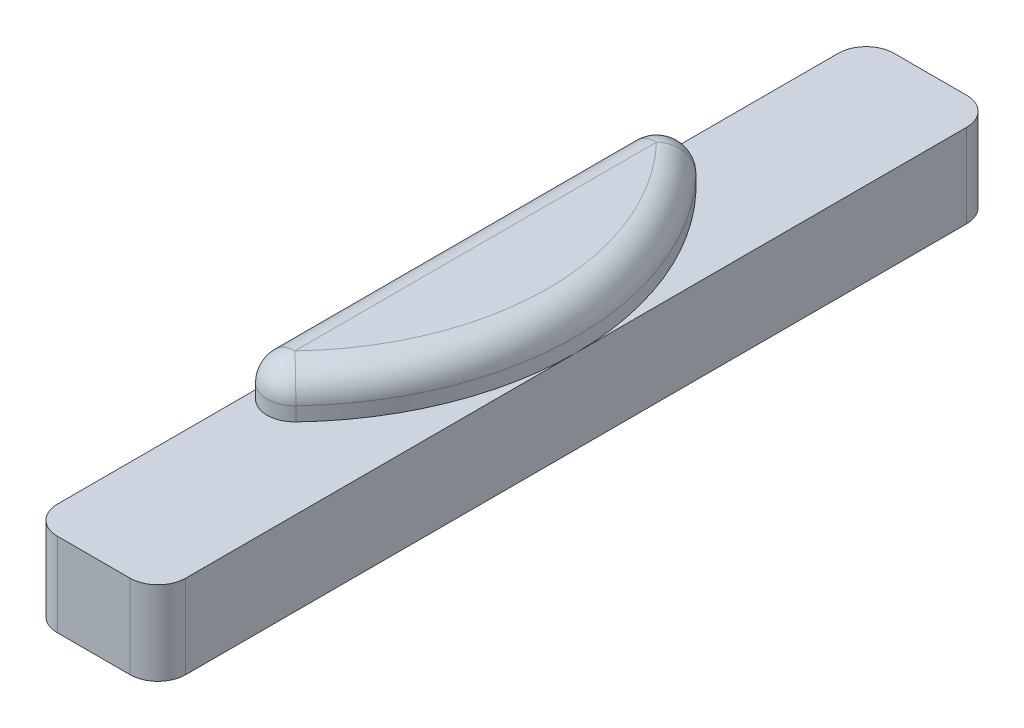
ISO-10303-21;
HEADER;
FILE_DESCRIPTION(('STEP AP214'),'2;1');
FILE_NAME('part.step','',(''),(''),'','','');
FILE_SCHEMA(('AUTOMOTIVE_DESIGN { 1 0 10303 214 1 1 1 1 }'));
ENDSEC;
DATA;
#1=APPLICATION_CONTEXT('core data for automotive mechanical design processes');
#2=APPLICATION_PROTOCOL_DEFINITION('international standard','automotive_design',2000,#1);
#3=PRODUCT_CONTEXT('',#1,'mechanical');
#4=PRODUCT('Part','Part','',(#3));
#5=PRODUCT_RELATED_PRODUCT_CATEGORY('part','',(#4));
#6=PRODUCT_DEFINITION_FORMATION('','',#4);
#7=PRODUCT_DEFINITION_CONTEXT('part definition',#1,'design');
#8=PRODUCT_DEFINITION('design','',#6,#7);
#9=PRODUCT_DEFINITION_SHAPE('','',#8);
#10=(LENGTH_UNIT() NAMED_UNIT(*) SI_UNIT(.MILLI.,.METRE.));
#11=(NAMED_UNIT(*) PLANE_ANGLE_UNIT() SI_UNIT($,.RADIAN.));
#12=(NAMED_UNIT(*) SI_UNIT($,.STERADIAN.) SOLID_ANGLE_UNIT());
#13=UNCERTAINTY_MEASURE_WITH_UNIT(LENGTH_MEASURE(1.E-05),#10,'distance_accuracy_value','');
#14=(GEOMETRIC_REPRESENTATION_CONTEXT(3) GLOBAL_UNCERTAINTY_ASSIGNED_CONTEXT((#13)) GLOBAL_UNIT_ASSIGNED_CONTEXT((#10,
#11,#12)) REPRESENTATION_CONTEXT('',''));
#15=CARTESIAN_POINT('',(0.,0.,0.));
#16=DIRECTION('',(0.,0.,1.));
#17=DIRECTION('',(1.,0.,0.));
#18=AXIS2_PLACEMENT_3D('',#15,#16,#17);
#19=CARTESIAN_POINT('',(0.,6.,0.));
#20=DIRECTION('',(0.,1.,0.));
#21=DIRECTION('',(0.,0.,1.));
#22=AXIS2_PLACEMENT_3D('',#19,#20,#21);
#23=PLANE('',#22);
#24=DIRECTION('',(0.,0.,-1.));
#25=VECTOR('',#24,1.);
#26=CARTESIAN_POINT('',(0.,6.,0.));
#27=LINE('',#26,#25);
#28=CARTESIAN_POINT('',(0.,6.,10.75));
#29=VERTEX_POINT('',#28);
#30=CARTESIAN_POINT('',(0.,6.,-4.28128765065706));
#31=VERTEX_POINT('',#30);
#32=EDGE_CURVE('E177',#29,#31,#27,.T.);
#33=ORIENTED_EDGE('',*,*,#32,.F.);
#34=CARTESIAN_POINT('',(2.,6.,10.75));
#35=DIRECTION('',(0.,1.,0.));
#36=DIRECTION('',(0.,0.,1.));
#37=AXIS2_PLACEMENT_3D('',#34,#35,#36);
#38=CIRCLE('',#37,2.);
#39=CARTESIAN_POINT('',(2.,6.,12.75));
#40=VERTEX_POINT('',#39);
#41=EDGE_CURVE('E246',#29,#40,#38,.T.);
#42=ORIENTED_EDGE('',*,*,#41,.T.);
#43=DIRECTION('',(1.,0.,0.));
#44=VECTOR('',#43,1.);
#45=CARTESIAN_POINT('',(0.,6.,12.75));
#46=LINE('',#45,#44);
#47=CARTESIAN_POINT('',(7.2,6.,12.75));
#48=VERTEX_POINT('',#47);
#49=EDGE_CURVE('E176',#40,#48,#46,.T.);
#50=ORIENTED_EDGE('',*,*,#49,.T.);
#51=CARTESIAN_POINT('',(7.2,6.,10.75));
#52=DIRECTION('',(0.,1.,0.));
#53=DIRECTION('',(0.,0.,1.));
#54=AXIS2_PLACEMENT_3D('',#51,#52,#53);
#55=CIRCLE('',#54,2.);
#56=CARTESIAN_POINT('',(9.2,6.,10.75));
#57=VERTEX_POINT('',#56);
#58=EDGE_CURVE('E148',#48,#57,#55,.T.);
#59=ORIENTED_EDGE('',*,*,#58,.T.);
#60=DIRECTION('',(0.,0.,-1.));
#61=VECTOR('',#60,1.);
#62=CARTESIAN_POINT('',(9.2,6.,0.));
#63=LINE('',#62,#61);
#64=CARTESIAN_POINT('',(9.2,6.,-17.25));
#65=VERTEX_POINT('',#64);
#66=EDGE_CURVE('E141',#57,#65,#63,.T.);
#67=ORIENTED_EDGE('',*,*,#66,.T.);
#68=CARTESIAN_POINT('',(-11.571875,6.,-17.25));
#69=DIRECTION('',(0.,1.,0.));
#70=DIRECTION('',(0.,0.,1.));
#71=AXIS2_PLACEMENT_3D('',#68,#69,#70);
#72=CIRCLE('',#71,20.771875);
#73=CARTESIAN_POINT('',(3.44597969036124,6.,-2.8995703369265));
#74=VERTEX_POINT('',#73);
#75=EDGE_CURVE('E145',#74,#65,#72,.T.);
#76=ORIENTED_EDGE('',*,*,#75,.F.);
#77=CARTESIAN_POINT('',(2.,6.,-4.28128765065706));
#78=DIRECTION('',(0.,1.,0.));
#79=DIRECTION('',(0.,0.,1.));
#80=AXIS2_PLACEMENT_3D('',#77,#78,#79);
#81=CIRCLE('',#80,2.);
#82=EDGE_CURVE('E213',#74,#31,#81,.F.);
#83=ORIENTED_EDGE('',*,*,#82,.T.);
#84=EDGE_LOOP('',(#33,#42,#50,#59,#67,#76,#83));
#85=FACE_BOUND('',#84,.T.);
#86=ADVANCED_FACE('F43',(#85),#23,.T.);
#87=CARTESIAN_POINT('',(0.,6.,0.));
#88=DIRECTION('',(-1.,0.,0.));
#89=DIRECTION('',(0.,0.,1.));
#90=AXIS2_PLACEMENT_3D('',#87,#88,#89);
#91=PLANE('',#90);
#92=DIRECTION('',(0.,0.,-1.));
#93=VECTOR('',#92,1.);
#94=CARTESIAN_POINT('',(0.,0.,0.));
#95=LINE('',#94,#93);
#96=CARTESIAN_POINT('',(0.,0.,10.75));
#97=VERTEX_POINT('',#96);
#98=CARTESIAN_POINT('',(0.,0.,-45.25));
#99=VERTEX_POINT('',#98);
#100=EDGE_CURVE('E166',#97,#99,#95,.T.);
#101=ORIENTED_EDGE('',*,*,#100,.F.);
#102=DIRECTION('',(0.,-1.,0.));
#103=VECTOR('',#102,1.);
#104=CARTESIAN_POINT('',(0.,6.,10.75));
#105=LINE('',#104,#103);
#106=EDGE_CURVE('E243',#97,#29,#105,.F.);
#107=ORIENTED_EDGE('',*,*,#106,.T.);
#108=ORIENTED_EDGE('',*,*,#32,.T.);
#109=DIRECTION('',(0.,-1.,0.));
#110=VECTOR('',#109,1.);
#111=CARTESIAN_POINT('',(0.,6.,-4.28128765065706));
#112=LINE('',#111,#110);
#113=CARTESIAN_POINT('',(0.,7.,-4.28128765065706));
#114=VERTEX_POINT('',#113);
#115=EDGE_CURVE('E205',#31,#114,#112,.F.);
#116=ORIENTED_EDGE('',*,*,#115,.T.);
#117=DIRECTION('',(0.,0.,-1.));
#118=VECTOR('',#117,1.);
#119=CARTESIAN_POINT('',(0.,7.,0.));
#120=LINE('',#119,#118);
#121=CARTESIAN_POINT('',(0.,7.,-30.2187123493429));
#122=VERTEX_POINT('',#121);
#123=EDGE_CURVE('E203',#114,#122,#120,.T.);
#124=ORIENTED_EDGE('',*,*,#123,.T.);
#125=DIRECTION('',(0.,-1.,0.));
#126=VECTOR('',#125,1.);
#127=CARTESIAN_POINT('',(0.,6.,-30.2187123493429));
#128=LINE('',#127,#126);
#129=CARTESIAN_POINT('',(0.,6.,-30.2187123493429));
#130=VERTEX_POINT('',#129);
#131=EDGE_CURVE('E200',#122,#130,#128,.T.);
#132=ORIENTED_EDGE('',*,*,#131,.T.);
#133=CARTESIAN_POINT('',(0.,6.,-45.25));
#134=VERTEX_POINT('',#133);
#135=EDGE_CURVE('E192',#130,#134,#27,.T.);
#136=ORIENTED_EDGE('',*,*,#135,.T.);
#137=DIRECTION('',(0.,-1.,0.));
#138=VECTOR('',#137,1.);
#139=CARTESIAN_POINT('',(0.,0.,-45.25));
#140=LINE('',#139,#138);
#141=EDGE_CURVE('E240',#134,#99,#140,.T.);
#142=ORIENTED_EDGE('',*,*,#141,.T.);
#143=EDGE_LOOP('',(#101,#107,#108,#116,#124,#132,#136,#142));
#144=FACE_BOUND('',#143,.T.);
#145=ADVANCED_FACE('F260',(#144),#91,.T.);
#146=CARTESIAN_POINT('',(0.,6.,12.75));
#147=DIRECTION('',(0.,0.,-1.));
#148=DIRECTION('',(-1.,0.,0.));
#149=AXIS2_PLACEMENT_3D('',#146,#147,#148);
#150=PLANE('',#149);
#151=ORIENTED_EDGE('',*,*,#49,.F.);
#152=DIRECTION('',(0.,-1.,0.));
#153=VECTOR('',#152,1.);
#154=CARTESIAN_POINT('',(2.,0.,12.75));
#155=LINE('',#154,#153);
#156=CARTESIAN_POINT('',(2.,0.,12.75));
#157=VERTEX_POINT('',#156);
#158=EDGE_CURVE('E229',#40,#157,#155,.T.);
#159=ORIENTED_EDGE('',*,*,#158,.T.);
#160=DIRECTION('',(1.,0.,0.));
#161=VECTOR('',#160,1.);
#162=CARTESIAN_POINT('',(0.,0.,12.75));
#163=LINE('',#162,#161);
#164=CARTESIAN_POINT('',(7.2,0.,12.75));
#165=VERTEX_POINT('',#164);
#166=EDGE_CURVE('E185',#157,#165,#163,.T.);
#167=ORIENTED_EDGE('',*,*,#166,.T.);
#168=DIRECTION('',(0.,-1.,0.));
#169=VECTOR('',#168,1.);
#170=CARTESIAN_POINT('',(7.2,6.,12.75));
#171=LINE('',#170,#169);
#172=EDGE_CURVE('E216',#165,#48,#171,.F.);
#173=ORIENTED_EDGE('',*,*,#172,.T.);
#174=EDGE_LOOP('',(#151,#159,#167,#173));
#175=FACE_BOUND('',#174,.T.);
#176=ADVANCED_FACE('F276',(#175),#150,.F.);
#177=CARTESIAN_POINT('',(9.2,6.,0.));
#178=DIRECTION('',(-1.,0.,0.));
#179=DIRECTION('',(0.,0.,1.));
#180=AXIS2_PLACEMENT_3D('',#177,#178,#179);
#181=PLANE('',#180);
#182=ORIENTED_EDGE('',*,*,#66,.F.);
#183=DIRECTION('',(0.,-1.,0.));
#184=VECTOR('',#183,1.);
#185=CARTESIAN_POINT('',(9.2,6.,10.75));
#186=LINE('',#185,#184);
#187=CARTESIAN_POINT('',(9.2,0.,10.75));
#188=VERTEX_POINT('',#187);
#189=EDGE_CURVE('E249',#57,#188,#186,.T.);
#190=ORIENTED_EDGE('',*,*,#189,.T.);
#191=DIRECTION('',(0.,0.,-1.));
#192=VECTOR('',#191,1.);
#193=CARTESIAN_POINT('',(9.2,0.,0.));
#194=LINE('',#193,#192);
#195=CARTESIAN_POINT('',(9.2,0.,-45.25));
#196=VERTEX_POINT('',#195);
#197=EDGE_CURVE('E188',#188,#196,#194,.T.);
#198=ORIENTED_EDGE('',*,*,#197,.T.);
#199=DIRECTION('',(0.,-1.,0.));
#200=VECTOR('',#199,1.);
#201=CARTESIAN_POINT('',(9.2,6.,-45.25));
#202=LINE('',#201,#200);
#203=CARTESIAN_POINT('',(9.2,6.,-45.25));
#204=VERTEX_POINT('',#203);
#205=EDGE_CURVE('E175',#196,#204,#202,.F.);
#206=ORIENTED_EDGE('',*,*,#205,.T.);
#207=EDGE_CURVE('E154',#65,#204,#63,.T.);
#208=ORIENTED_EDGE('',*,*,#207,.F.);
#209=EDGE_LOOP('',(#182,#190,#198,#206,#208));
#210=FACE_BOUND('',#209,.T.);
#211=ADVANCED_FACE('F172',(#210),#181,.F.);
#212=CARTESIAN_POINT('',(0.,6.,-47.25));
#213=DIRECTION('',(0.,0.,1.));
#214=DIRECTION('',(1.,0.,0.));
#215=AXIS2_PLACEMENT_3D('',#212,#213,#214);
#216=PLANE('',#215);
#217=DIRECTION('',(-1.,0.,0.));
#218=VECTOR('',#217,1.);
#219=CARTESIAN_POINT('',(0.,6.,-47.25));
#220=LINE('',#219,#218);
#221=CARTESIAN_POINT('',(7.2,6.,-47.25));
#222=VERTEX_POINT('',#221);
#223=CARTESIAN_POINT('',(2.,6.,-47.25));
#224=VERTEX_POINT('',#223);
#225=EDGE_CURVE('E153',#222,#224,#220,.T.);
#226=ORIENTED_EDGE('',*,*,#225,.F.);
#227=DIRECTION('',(0.,-1.,0.));
#228=VECTOR('',#227,1.);
#229=CARTESIAN_POINT('',(7.2,6.,-47.25));
#230=LINE('',#229,#228);
#231=CARTESIAN_POINT('',(7.2,0.,-47.25));
#232=VERTEX_POINT('',#231);
#233=EDGE_CURVE('E252',#222,#232,#230,.T.);
#234=ORIENTED_EDGE('',*,*,#233,.T.);
#235=DIRECTION('',(-1.,0.,0.));
#236=VECTOR('',#235,1.);
#237=CARTESIAN_POINT('',(0.,0.,-47.25));
#238=LINE('',#237,#236);
#239=CARTESIAN_POINT('',(2.,0.,-47.25));
#240=VERTEX_POINT('',#239);
#241=EDGE_CURVE('E190',#232,#240,#238,.T.);
#242=ORIENTED_EDGE('',*,*,#241,.T.);
#243=DIRECTION('',(0.,-1.,0.));
#244=VECTOR('',#243,1.);
#245=CARTESIAN_POINT('',(2.,6.,-47.25));
#246=LINE('',#245,#244);
#247=EDGE_CURVE('E58',#240,#224,#246,.F.);
#248=ORIENTED_EDGE('',*,*,#247,.T.);
#249=EDGE_LOOP('',(#226,#234,#242,#248));
#250=FACE_BOUND('',#249,.T.);
#251=ADVANCED_FACE('F266',(#250),#216,.F.);
#252=ORIENTED_EDGE('',*,*,#207,.T.);
#253=CARTESIAN_POINT('',(7.2,6.,-45.25));
#254=DIRECTION('',(0.,1.,0.));
#255=DIRECTION('',(0.,0.,1.));
#256=AXIS2_PLACEMENT_3D('',#253,#254,#255);
#257=CIRCLE('',#256,2.);
#258=EDGE_CURVE('E11',#204,#222,#257,.T.);
#259=ORIENTED_EDGE('',*,*,#258,.T.);
#260=ORIENTED_EDGE('',*,*,#225,.T.);
#261=CARTESIAN_POINT('',(2.,6.,-45.25));
#262=DIRECTION('',(0.,1.,0.));
#263=DIRECTION('',(0.,0.,1.));
#264=AXIS2_PLACEMENT_3D('',#261,#262,#263);
#265=CIRCLE('',#264,2.);
#266=EDGE_CURVE('E51',#224,#134,#265,.T.);
#267=ORIENTED_EDGE('',*,*,#266,.T.);
#268=ORIENTED_EDGE('',*,*,#135,.F.);
#269=CARTESIAN_POINT('',(2.,6.,-30.2187123493429));
#270=DIRECTION('',(0.,1.,0.));
#271=DIRECTION('',(0.,0.,1.));
#272=AXIS2_PLACEMENT_3D('',#269,#270,#271);
#273=CIRCLE('',#272,2.);
#274=CARTESIAN_POINT('',(3.44597969036124,6.,-31.6004296630735));
#275=VERTEX_POINT('',#274);
#276=EDGE_CURVE('E170',#130,#275,#273,.F.);
#277=ORIENTED_EDGE('',*,*,#276,.T.);
#278=EDGE_CURVE('E162',#65,#275,#72,.T.);
#279=ORIENTED_EDGE('',*,*,#278,.F.);
#280=EDGE_LOOP('',(#252,#259,#260,#267,#268,#277,#279));
#281=FACE_BOUND('',#280,.T.);
#282=ADVANCED_FACE('F168',(#281),#23,.T.);
#283=CARTESIAN_POINT('',(0.,0.,0.));
#284=DIRECTION('',(0.,1.,0.));
#285=DIRECTION('',(0.,0.,1.));
#286=AXIS2_PLACEMENT_3D('',#283,#284,#285);
#287=PLANE('',#286);
#288=ORIENTED_EDGE('',*,*,#166,.F.);
#289=CARTESIAN_POINT('',(2.,0.,10.75));
#290=DIRECTION('',(0.,1.,0.));
#291=DIRECTION('',(0.,0.,1.));
#292=AXIS2_PLACEMENT_3D('',#289,#290,#291);
#293=CIRCLE('',#292,2.);
#294=EDGE_CURVE('E238',#157,#97,#293,.F.);
#295=ORIENTED_EDGE('',*,*,#294,.T.);
#296=ORIENTED_EDGE('',*,*,#100,.T.);
#297=CARTESIAN_POINT('',(2.,0.,-45.25));
#298=DIRECTION('',(0.,1.,0.));
#299=DIRECTION('',(0.,0.,1.));
#300=AXIS2_PLACEMENT_3D('',#297,#298,#299);
#301=CIRCLE('',#300,2.);
#302=EDGE_CURVE('E232',#99,#240,#301,.F.);
#303=ORIENTED_EDGE('',*,*,#302,.T.);
#304=ORIENTED_EDGE('',*,*,#241,.F.);
#305=CARTESIAN_POINT('',(7.2,0.,-45.25));
#306=DIRECTION('',(0.,1.,0.));
#307=DIRECTION('',(0.,0.,1.));
#308=AXIS2_PLACEMENT_3D('',#305,#306,#307);
#309=CIRCLE('',#308,2.);
#310=EDGE_CURVE('E234',#232,#196,#309,.F.);
#311=ORIENTED_EDGE('',*,*,#310,.T.);
#312=ORIENTED_EDGE('',*,*,#197,.F.);
#313=CARTESIAN_POINT('',(7.2,0.,10.75));
#314=DIRECTION('',(0.,1.,0.));
#315=DIRECTION('',(0.,0.,1.));
#316=AXIS2_PLACEMENT_3D('',#313,#314,#315);
#317=CIRCLE('',#316,2.);
#318=EDGE_CURVE('E236',#188,#165,#317,.F.);
#319=ORIENTED_EDGE('',*,*,#318,.T.);
#320=EDGE_LOOP('',(#288,#295,#296,#303,#304,#311,#312,#319));
#321=FACE_BOUND('',#320,.T.);
#322=ADVANCED_FACE('F265',(#321),#287,.F.);
#323=CARTESIAN_POINT('',(-11.571875,9.,-17.25));
#324=DIRECTION('',(0.,-1.,0.));
#325=DIRECTION('',(0.,0.,-1.));
#326=AXIS2_PLACEMENT_3D('',#323,#324,#325);
#327=CYLINDRICAL_SURFACE('',#326,20.771875);
#328=CARTESIAN_POINT('',(-11.571875,7.,-17.25));
#329=DIRECTION('',(0.,1.,0.));
#330=DIRECTION('',(0.,0.,1.));
#331=AXIS2_PLACEMENT_3D('',#328,#329,#330);
#332=CIRCLE('',#331,20.771875);
#333=CARTESIAN_POINT('',(3.44597969036125,7.,-31.6004296630735));
#334=VERTEX_POINT('',#333);
#335=CARTESIAN_POINT('',(3.44597969036124,7.,-2.8995703369265));
#336=VERTEX_POINT('',#335);
#337=EDGE_CURVE('E182',#334,#336,#332,.F.);
#338=ORIENTED_EDGE('',*,*,#337,.T.);
#339=DIRECTION('',(0.,-1.,0.));
#340=VECTOR('',#339,1.);
#341=CARTESIAN_POINT('',(3.44597969036124,9.,-2.8995703369265));
#342=LINE('',#341,#340);
#343=EDGE_CURVE('E165',#336,#74,#342,.T.);
#344=ORIENTED_EDGE('',*,*,#343,.T.);
#345=ORIENTED_EDGE('',*,*,#75,.T.);
#346=ORIENTED_EDGE('',*,*,#278,.T.);
#347=DIRECTION('',(0.,-1.,0.));
#348=VECTOR('',#347,1.);
#349=CARTESIAN_POINT('',(3.44597969036125,9.,-31.6004296630735));
#350=LINE('',#349,#348);
#351=EDGE_CURVE('E197',#275,#334,#350,.F.);
#352=ORIENTED_EDGE('',*,*,#351,.T.);
#353=EDGE_LOOP('',(#338,#344,#345,#346,#352));
#354=FACE_BOUND('',#353,.T.);
#355=ADVANCED_FACE('F161',(#354),#327,.T.);
#356=CARTESIAN_POINT('',(0.,9.,0.));
#357=DIRECTION('',(0.,1.,0.));
#358=DIRECTION('',(0.,0.,1.));
#359=AXIS2_PLACEMENT_3D('',#356,#357,#358);
#360=PLANE('',#359);
#361=CARTESIAN_POINT('',(-11.571875,9.,-17.25));
#362=DIRECTION('',(0.,1.,0.));
#363=DIRECTION('',(0.,0.,1.));
#364=AXIS2_PLACEMENT_3D('',#361,#362,#363);
#365=CIRCLE('',#364,18.771875);
#366=CARTESIAN_POINT('',(2.,9.,-4.28128765065706));
#367=VERTEX_POINT('',#366);
#368=CARTESIAN_POINT('',(2.,9.,-30.2187123493429));
#369=VERTEX_POINT('',#368);
#370=EDGE_CURVE('E194',#367,#369,#365,.T.);
#371=ORIENTED_EDGE('',*,*,#370,.T.);
#372=DIRECTION('',(0.,0.,-1.));
#373=VECTOR('',#372,1.);
#374=CARTESIAN_POINT('',(2.,9.,0.));
#375=LINE('',#374,#373);
#376=EDGE_CURVE('E211',#369,#367,#375,.F.);
#377=ORIENTED_EDGE('',*,*,#376,.T.);
#378=EDGE_LOOP('',(#371,#377));
#379=FACE_BOUND('',#378,.T.);
#380=ADVANCED_FACE('F306',(#379),#360,.T.);
#381=CARTESIAN_POINT('',(-11.571875,7.,-17.25));
#382=DIRECTION('',(0.,1.,0.));
#383=DIRECTION('',(0.,0.,1.));
#384=AXIS2_PLACEMENT_3D('',#381,#382,#383);
#385=TOROIDAL_SURFACE('',#384,18.771875,2.);
#386=ORIENTED_EDGE('',*,*,#370,.F.);
#387=CARTESIAN_POINT('',(2.,7.,-4.28128765065706));
#388=DIRECTION('',(0.69085865686528,0.,-0.722989845180623));
#389=DIRECTION('',(-0.722989845180623,0.,-0.69085865686528));
#390=AXIS2_PLACEMENT_3D('',#387,#388,#389);
#391=CIRCLE('',#390,2.);
#392=EDGE_CURVE('E209',#367,#336,#391,.T.);
#393=ORIENTED_EDGE('',*,*,#392,.T.);
#394=ORIENTED_EDGE('',*,*,#337,.F.);
#395=CARTESIAN_POINT('',(2.,7.,-30.2187123493429));
#396=DIRECTION('',(-0.69085865686528,0.,-0.722989845180623));
#397=DIRECTION('',(-0.722989845180623,0.,0.69085865686528));
#398=AXIS2_PLACEMENT_3D('',#395,#396,#397);
#399=CIRCLE('',#398,2.);
#400=EDGE_CURVE('E207',#334,#369,#399,.F.);
#401=ORIENTED_EDGE('',*,*,#400,.T.);
#402=EDGE_LOOP('',(#386,#393,#394,#401));
#403=FACE_BOUND('',#402,.T.);
#404=ADVANCED_FACE('F298',(#403),#385,.T.);
#405=CARTESIAN_POINT('',(2.,9.,-30.2187123493429));
#406=DIRECTION('',(0.,-1.,0.));
#407=DIRECTION('',(0.,0.,-1.));
#408=AXIS2_PLACEMENT_3D('',#405,#406,#407);
#409=CYLINDRICAL_SURFACE('',#408,2.);
#410=CARTESIAN_POINT('',(2.,7.,-30.2187123493429));
#411=DIRECTION('',(0.,1.,0.));
#412=DIRECTION('',(0.,0.,1.));
#413=AXIS2_PLACEMENT_3D('',#410,#411,#412);
#414=CIRCLE('',#413,2.);
#415=EDGE_CURVE('E171',#334,#122,#414,.T.);
#416=ORIENTED_EDGE('',*,*,#415,.F.);
#417=ORIENTED_EDGE('',*,*,#351,.F.);
#418=ORIENTED_EDGE('',*,*,#276,.F.);
#419=ORIENTED_EDGE('',*,*,#131,.F.);
#420=EDGE_LOOP('',(#416,#417,#418,#419));
#421=FACE_BOUND('',#420,.T.);
#422=ADVANCED_FACE('F301',(#421),#409,.T.);
#423=CARTESIAN_POINT('',(2.,7.,-30.2187123493429));
#424=DIRECTION('',(-1.,0.,0.));
#425=DIRECTION('',(0.,0.,1.));
#426=AXIS2_PLACEMENT_3D('',#423,#424,#425);
#427=SPHERICAL_SURFACE('',#426,2.);
#428=ORIENTED_EDGE('',*,*,#400,.F.);
#429=ORIENTED_EDGE('',*,*,#415,.T.);
#430=CARTESIAN_POINT('',(2.,7.,-30.2187123493429));
#431=DIRECTION('',(0.,0.,1.));
#432=DIRECTION('',(1.,0.,0.));
#433=AXIS2_PLACEMENT_3D('',#430,#431,#432);
#434=CIRCLE('',#433,2.);
#435=EDGE_CURVE('E223',#369,#122,#434,.T.);
#436=ORIENTED_EDGE('',*,*,#435,.F.);
#437=EDGE_LOOP('',(#428,#429,#436));
#438=FACE_BOUND('',#437,.T.);
#439=ADVANCED_FACE('F304',(#438),#427,.T.);
#440=CARTESIAN_POINT('',(2.,7.,0.));
#441=DIRECTION('',(0.,0.,-1.));
#442=DIRECTION('',(-1.,0.,0.));
#443=AXIS2_PLACEMENT_3D('',#440,#441,#442);
#444=CYLINDRICAL_SURFACE('',#443,2.);
#445=CARTESIAN_POINT('',(2.,7.,-4.28128765065706));
#446=DIRECTION('',(0.,0.,1.));
#447=DIRECTION('',(1.,0.,0.));
#448=AXIS2_PLACEMENT_3D('',#445,#446,#447);
#449=CIRCLE('',#448,2.);
#450=EDGE_CURVE('E220',#367,#114,#449,.T.);
#451=ORIENTED_EDGE('',*,*,#450,.F.);
#452=ORIENTED_EDGE('',*,*,#376,.F.);
#453=ORIENTED_EDGE('',*,*,#435,.T.);
#454=ORIENTED_EDGE('',*,*,#123,.F.);
#455=EDGE_LOOP('',(#451,#452,#453,#454));
#456=FACE_BOUND('',#455,.T.);
#457=ADVANCED_FACE('F289',(#456),#444,.T.);
#458=CARTESIAN_POINT('',(2.,7.,-4.28128765065706));
#459=DIRECTION('',(-1.,0.,0.));
#460=DIRECTION('',(0.,0.,1.));
#461=AXIS2_PLACEMENT_3D('',#458,#459,#460);
#462=SPHERICAL_SURFACE('',#461,2.);
#463=ORIENTED_EDGE('',*,*,#392,.F.);
#464=ORIENTED_EDGE('',*,*,#450,.T.);
#465=CARTESIAN_POINT('',(2.,7.,-4.28128765065706));
#466=DIRECTION('',(0.,-1.,0.));
#467=DIRECTION('',(0.,0.,-1.));
#468=AXIS2_PLACEMENT_3D('',#465,#466,#467);
#469=CIRCLE('',#468,2.);
#470=EDGE_CURVE('E217',#336,#114,#469,.T.);
#471=ORIENTED_EDGE('',*,*,#470,.F.);
#472=EDGE_LOOP('',(#463,#464,#471));
#473=FACE_BOUND('',#472,.T.);
#474=ADVANCED_FACE('F294',(#473),#462,.T.);
#475=CARTESIAN_POINT('',(2.,9.,-4.28128765065706));
#476=DIRECTION('',(0.,-1.,0.));
#477=DIRECTION('',(0.,0.,-1.));
#478=AXIS2_PLACEMENT_3D('',#475,#476,#477);
#479=CYLINDRICAL_SURFACE('',#478,2.);
#480=ORIENTED_EDGE('',*,*,#470,.T.);
#481=ORIENTED_EDGE('',*,*,#115,.F.);
#482=ORIENTED_EDGE('',*,*,#82,.F.);
#483=ORIENTED_EDGE('',*,*,#343,.F.);
#484=EDGE_LOOP('',(#480,#481,#482,#483));
#485=FACE_BOUND('',#484,.T.);
#486=ADVANCED_FACE('F284',(#485),#479,.T.);
#487=CARTESIAN_POINT('',(2.,6.,10.75));
#488=DIRECTION('',(0.,1.,0.));
#489=DIRECTION('',(0.,0.,1.));
#490=AXIS2_PLACEMENT_3D('',#487,#488,#489);
#491=CYLINDRICAL_SURFACE('',#490,2.);
#492=ORIENTED_EDGE('',*,*,#41,.F.);
#493=ORIENTED_EDGE('',*,*,#106,.F.);
#494=ORIENTED_EDGE('',*,*,#294,.F.);
#495=ORIENTED_EDGE('',*,*,#158,.F.);
#496=EDGE_LOOP('',(#492,#493,#494,#495));
#497=FACE_BOUND('',#496,.T.);
#498=ADVANCED_FACE('F280',(#497),#491,.T.);
#499=CARTESIAN_POINT('',(7.2,6.,10.75));
#500=DIRECTION('',(0.,-1.,0.));
#501=DIRECTION('',(0.,0.,-1.));
#502=AXIS2_PLACEMENT_3D('',#499,#500,#501);
#503=CYLINDRICAL_SURFACE('',#502,2.);
#504=ORIENTED_EDGE('',*,*,#58,.F.);
#505=ORIENTED_EDGE('',*,*,#172,.F.);
#506=ORIENTED_EDGE('',*,*,#318,.F.);
#507=ORIENTED_EDGE('',*,*,#189,.F.);
#508=EDGE_LOOP('',(#504,#505,#506,#507));
#509=FACE_BOUND('',#508,.T.);
#510=ADVANCED_FACE('F272',(#509),#503,.T.);
#511=CARTESIAN_POINT('',(7.2,6.,-45.25));
#512=DIRECTION('',(0.,-1.,0.));
#513=DIRECTION('',(0.,0.,-1.));
#514=AXIS2_PLACEMENT_3D('',#511,#512,#513);
#515=CYLINDRICAL_SURFACE('',#514,2.);
#516=ORIENTED_EDGE('',*,*,#258,.F.);
#517=ORIENTED_EDGE('',*,*,#205,.F.);
#518=ORIENTED_EDGE('',*,*,#310,.F.);
#519=ORIENTED_EDGE('',*,*,#233,.F.);
#520=EDGE_LOOP('',(#516,#517,#518,#519));
#521=FACE_BOUND('',#520,.T.);
#522=ADVANCED_FACE('F269',(#521),#515,.T.);
#523=CARTESIAN_POINT('',(2.,6.,-45.25));
#524=DIRECTION('',(0.,1.,0.));
#525=DIRECTION('',(0.,0.,1.));
#526=AXIS2_PLACEMENT_3D('',#523,#524,#525);
#527=CYLINDRICAL_SURFACE('',#526,2.);
#528=ORIENTED_EDGE('',*,*,#266,.F.);
#529=ORIENTED_EDGE('',*,*,#247,.F.);
#530=ORIENTED_EDGE('',*,*,#302,.F.);
#531=ORIENTED_EDGE('',*,*,#141,.F.);
#532=EDGE_LOOP('',(#528,#529,#530,#531));
#533=FACE_BOUND('',#532,.T.);
#534=ADVANCED_FACE('F45',(#533),#527,.T.);
#535=CLOSED_SHELL('',(#86,#145,#176,#211,#251,#282,#322,#355,#380,#404,#422,#439,#457,#474,#486,
#498,#510,#522,#534));
#536=MANIFOLD_SOLID_BREP('B2',#535);
#537=ADVANCED_BREP_SHAPE_REPRESENTATION('',(#18,#536),#14);
#538=SHAPE_DEFINITION_REPRESENTATION(#9,#537);
ENDSEC;
END-ISO-10303-21;
